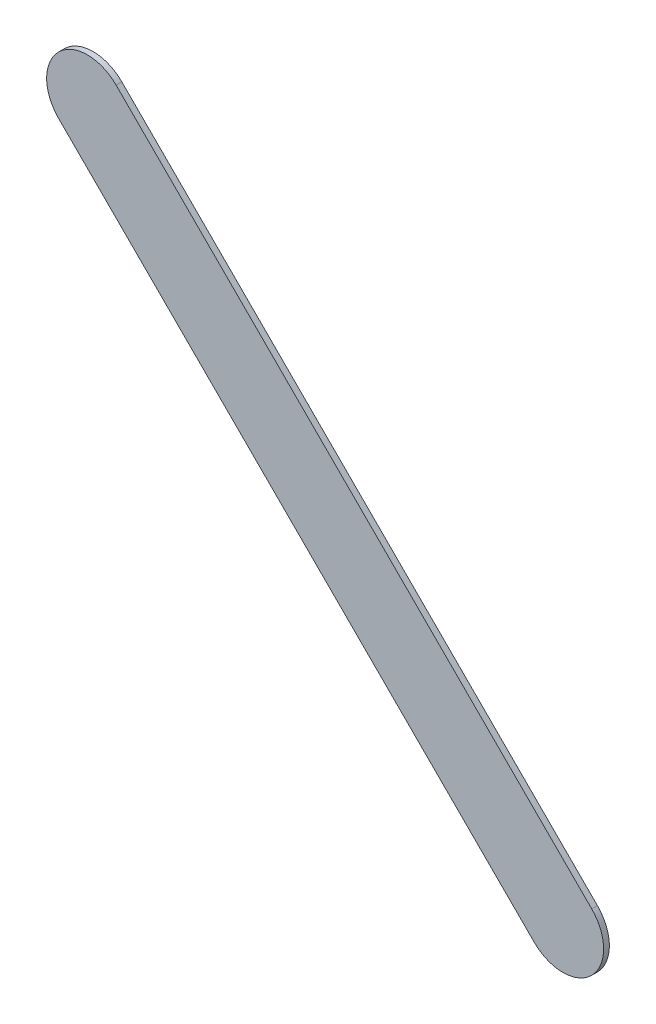
ISO-10303-21;
HEADER;
FILE_DESCRIPTION(('STEP AP214'),'2;1');
FILE_NAME('part.step','',(''),(''),'','','');
FILE_SCHEMA(('AUTOMOTIVE_DESIGN { 1 0 10303 214 1 1 1 1 }'));
ENDSEC;
DATA;
#1=APPLICATION_CONTEXT('core data for automotive mechanical design processes');
#2=APPLICATION_PROTOCOL_DEFINITION('international standard','automotive_design',2000,#1);
#3=PRODUCT_CONTEXT('',#1,'mechanical');
#4=PRODUCT('Part','Part','',(#3));
#5=PRODUCT_RELATED_PRODUCT_CATEGORY('part','',(#4));
#6=PRODUCT_DEFINITION_FORMATION('','',#4);
#7=PRODUCT_DEFINITION_CONTEXT('part definition',#1,'design');
#8=PRODUCT_DEFINITION('design','',#6,#7);
#9=PRODUCT_DEFINITION_SHAPE('','',#8);
#10=(LENGTH_UNIT() NAMED_UNIT(*) SI_UNIT(.MILLI.,.METRE.));
#11=(NAMED_UNIT(*) PLANE_ANGLE_UNIT() SI_UNIT($,.RADIAN.));
#12=(NAMED_UNIT(*) SI_UNIT($,.STERADIAN.) SOLID_ANGLE_UNIT());
#13=UNCERTAINTY_MEASURE_WITH_UNIT(LENGTH_MEASURE(1.E-05),#10,'distance_accuracy_value','');
#14=(GEOMETRIC_REPRESENTATION_CONTEXT(3) GLOBAL_UNCERTAINTY_ASSIGNED_CONTEXT((#13)) GLOBAL_UNIT_ASSIGNED_CONTEXT((#10,
#11,#12)) REPRESENTATION_CONTEXT('',''));
#15=CARTESIAN_POINT('',(0.,0.,0.));
#16=DIRECTION('',(0.,0.,1.));
#17=DIRECTION('',(1.,0.,0.));
#18=AXIS2_PLACEMENT_3D('',#15,#16,#17);
#19=CARTESIAN_POINT('',(164.669223,-123.620776,0.));
#20=DIRECTION('',(0.,0.,1.));
#21=DIRECTION('',(1.,0.,0.));
#22=AXIS2_PLACEMENT_3D('',#19,#20,#21);
#23=PLANE('',#22);
#24=DIRECTION('',(0.707106781186548,-0.707106781186548,0.));
#25=VECTOR('',#24,1.);
#26=CARTESIAN_POINT('',(164.669223,-123.620776,0.));
#27=LINE('',#26,#25);
#28=CARTESIAN_POINT('',(164.669223,-123.620776,0.));
#29=VERTEX_POINT('',#28);
#30=CARTESIAN_POINT('',(167.590223,-126.541776,0.));
#31=VERTEX_POINT('',#30);
#32=EDGE_CURVE('E81',#29,#31,#27,.T.);
#33=ORIENTED_EDGE('',*,*,#32,.T.);
#34=CARTESIAN_POINT('',(167.7669995,-126.3649995,0.));
#35=DIRECTION('',(0.,0.,1.));
#36=DIRECTION('',(-0.707106781186548,-0.707106781186548,0.));
#37=AXIS2_PLACEMENT_3D('',#34,#35,#36);
#38=CIRCLE('',#37,0.249999723809);
#39=CARTESIAN_POINT('',(167.943776,-126.188223,0.));
#40=VERTEX_POINT('',#39);
#41=EDGE_CURVE('E105',#31,#40,#38,.T.);
#42=ORIENTED_EDGE('',*,*,#41,.T.);
#43=DIRECTION('',(-0.707106781186548,0.707106781186548,0.));
#44=VECTOR('',#43,1.);
#45=CARTESIAN_POINT('',(167.943776,-126.188223,0.));
#46=LINE('',#45,#44);
#47=CARTESIAN_POINT('',(165.022776,-123.267223,0.));
#48=VERTEX_POINT('',#47);
#49=EDGE_CURVE('E20',#40,#48,#46,.T.);
#50=ORIENTED_EDGE('',*,*,#49,.T.);
#51=CARTESIAN_POINT('',(164.8459995,-123.4439995,0.));
#52=DIRECTION('',(0.,0.,1.));
#53=DIRECTION('',(0.707106781186548,0.707106781186548,0.));
#54=AXIS2_PLACEMENT_3D('',#51,#52,#53);
#55=CIRCLE('',#54,0.249999723809);
#56=EDGE_CURVE('E11',#48,#29,#55,.T.);
#57=ORIENTED_EDGE('',*,*,#56,.T.);
#58=EDGE_LOOP('',(#33,#42,#50,#57));
#59=FACE_BOUND('',#58,.T.);
#60=ADVANCED_FACE('F17',(#59),#23,.T.);
#61=CARTESIAN_POINT('',(164.669223,-123.620776,-0.035));
#62=DIRECTION('',(0.,0.,1.));
#63=DIRECTION('',(1.,0.,0.));
#64=AXIS2_PLACEMENT_3D('',#61,#62,#63);
#65=PLANE('',#64);
#66=CARTESIAN_POINT('',(164.8459995,-123.4439995,-0.035));
#67=DIRECTION('',(0.,0.,1.));
#68=DIRECTION('',(0.707106781186548,0.707106781186548,0.));
#69=AXIS2_PLACEMENT_3D('',#66,#67,#68);
#70=CIRCLE('',#69,0.249999723809);
#71=CARTESIAN_POINT('',(165.022776,-123.267223,-0.035));
#72=VERTEX_POINT('',#71);
#73=CARTESIAN_POINT('',(164.669223,-123.620776,-0.035));
#74=VERTEX_POINT('',#73);
#75=EDGE_CURVE('E26',#72,#74,#70,.T.);
#76=ORIENTED_EDGE('',*,*,#75,.F.);
#77=DIRECTION('',(-0.707106781186548,0.707106781186548,0.));
#78=VECTOR('',#77,1.);
#79=CARTESIAN_POINT('',(167.943776,-126.188223,-0.035));
#80=LINE('',#79,#78);
#81=CARTESIAN_POINT('',(167.943776,-126.188223,-0.035));
#82=VERTEX_POINT('',#81);
#83=EDGE_CURVE('E109',#82,#72,#80,.T.);
#84=ORIENTED_EDGE('',*,*,#83,.F.);
#85=CARTESIAN_POINT('',(167.7669995,-126.3649995,-0.035));
#86=DIRECTION('',(0.,0.,1.));
#87=DIRECTION('',(-0.707106781186548,-0.707106781186548,0.));
#88=AXIS2_PLACEMENT_3D('',#85,#86,#87);
#89=CIRCLE('',#88,0.249999723809);
#90=CARTESIAN_POINT('',(167.590223,-126.541776,-0.035));
#91=VERTEX_POINT('',#90);
#92=EDGE_CURVE('E83',#91,#82,#89,.T.);
#93=ORIENTED_EDGE('',*,*,#92,.F.);
#94=DIRECTION('',(0.707106781186548,-0.707106781186548,0.));
#95=VECTOR('',#94,1.);
#96=CARTESIAN_POINT('',(164.669223,-123.620776,-0.035));
#97=LINE('',#96,#95);
#98=EDGE_CURVE('E79',#74,#91,#97,.T.);
#99=ORIENTED_EDGE('',*,*,#98,.F.);
#100=EDGE_LOOP('',(#76,#84,#93,#99));
#101=FACE_BOUND('',#100,.T.);
#102=ADVANCED_FACE('F85',(#101),#65,.F.);
#103=CARTESIAN_POINT('',(164.8459995,-123.4439995,-0.035));
#104=DIRECTION('',(0.,0.,-1.));
#105=DIRECTION('',(0.707106781186548,0.707106781186548,0.));
#106=AXIS2_PLACEMENT_3D('',#103,#104,#105);
#107=CYLINDRICAL_SURFACE('',#106,0.249999723809);
#108=ORIENTED_EDGE('',*,*,#75,.T.);
#109=DIRECTION('',(0.,0.,1.));
#110=VECTOR('',#109,1.);
#111=CARTESIAN_POINT('',(164.669223,-123.620776,-0.035));
#112=LINE('',#111,#110);
#113=EDGE_CURVE('E68',#74,#29,#112,.T.);
#114=ORIENTED_EDGE('',*,*,#113,.T.);
#115=ORIENTED_EDGE('',*,*,#56,.F.);
#116=DIRECTION('',(0.,0.,1.));
#117=VECTOR('',#116,1.);
#118=CARTESIAN_POINT('',(165.022776,-123.267223,-0.035));
#119=LINE('',#118,#117);
#120=EDGE_CURVE('E71',#72,#48,#119,.T.);
#121=ORIENTED_EDGE('',*,*,#120,.F.);
#122=EDGE_LOOP('',(#108,#114,#115,#121));
#123=FACE_BOUND('',#122,.T.);
#124=ADVANCED_FACE('F67',(#123),#107,.T.);
#125=CARTESIAN_POINT('',(167.943776,-126.188223,-0.035));
#126=DIRECTION('',(-0.707106781186548,-0.707106781186548,0.));
#127=DIRECTION('',(-0.707106781186548,0.707106781186548,0.));
#128=AXIS2_PLACEMENT_3D('',#125,#126,#127);
#129=PLANE('',#128);
#130=ORIENTED_EDGE('',*,*,#83,.T.);
#131=ORIENTED_EDGE('',*,*,#120,.T.);
#132=ORIENTED_EDGE('',*,*,#49,.F.);
#133=DIRECTION('',(0.,0.,1.));
#134=VECTOR('',#133,1.);
#135=CARTESIAN_POINT('',(167.943776,-126.188223,-0.035));
#136=LINE('',#135,#134);
#137=EDGE_CURVE('E101',#82,#40,#136,.T.);
#138=ORIENTED_EDGE('',*,*,#137,.F.);
#139=EDGE_LOOP('',(#130,#131,#132,#138));
#140=FACE_BOUND('',#139,.T.);
#141=ADVANCED_FACE('F121',(#140),#129,.F.);
#142=CARTESIAN_POINT('',(167.7669995,-126.3649995,-0.035));
#143=DIRECTION('',(0.,0.,-1.));
#144=DIRECTION('',(-0.707106781186548,-0.707106781186548,0.));
#145=AXIS2_PLACEMENT_3D('',#142,#143,#144);
#146=CYLINDRICAL_SURFACE('',#145,0.249999723809);
#147=ORIENTED_EDGE('',*,*,#92,.T.);
#148=ORIENTED_EDGE('',*,*,#137,.T.);
#149=ORIENTED_EDGE('',*,*,#41,.F.);
#150=DIRECTION('',(0.,0.,1.));
#151=VECTOR('',#150,1.);
#152=CARTESIAN_POINT('',(167.590223,-126.541776,-0.035));
#153=LINE('',#152,#151);
#154=EDGE_CURVE('E89',#91,#31,#153,.T.);
#155=ORIENTED_EDGE('',*,*,#154,.F.);
#156=EDGE_LOOP('',(#147,#148,#149,#155));
#157=FACE_BOUND('',#156,.T.);
#158=ADVANCED_FACE('F123',(#157),#146,.T.);
#159=CARTESIAN_POINT('',(164.669223,-123.620776,-0.035));
#160=DIRECTION('',(0.707106781186548,0.707106781186548,0.));
#161=DIRECTION('',(0.,0.,-1.));
#162=AXIS2_PLACEMENT_3D('',#159,#160,#161);
#163=PLANE('',#162);
#164=ORIENTED_EDGE('',*,*,#98,.T.);
#165=ORIENTED_EDGE('',*,*,#154,.T.);
#166=ORIENTED_EDGE('',*,*,#32,.F.);
#167=ORIENTED_EDGE('',*,*,#113,.F.);
#168=EDGE_LOOP('',(#164,#165,#166,#167));
#169=FACE_BOUND('',#168,.T.);
#170=ADVANCED_FACE('F77',(#169),#163,.F.);
#171=CLOSED_SHELL('',(#60,#102,#124,#141,#158,#170));
#172=MANIFOLD_SOLID_BREP('B1',#171);
#173=ADVANCED_BREP_SHAPE_REPRESENTATION('',(#18,#172),#14);
#174=SHAPE_DEFINITION_REPRESENTATION(#9,#173);
ENDSEC;
END-ISO-10303-21;
